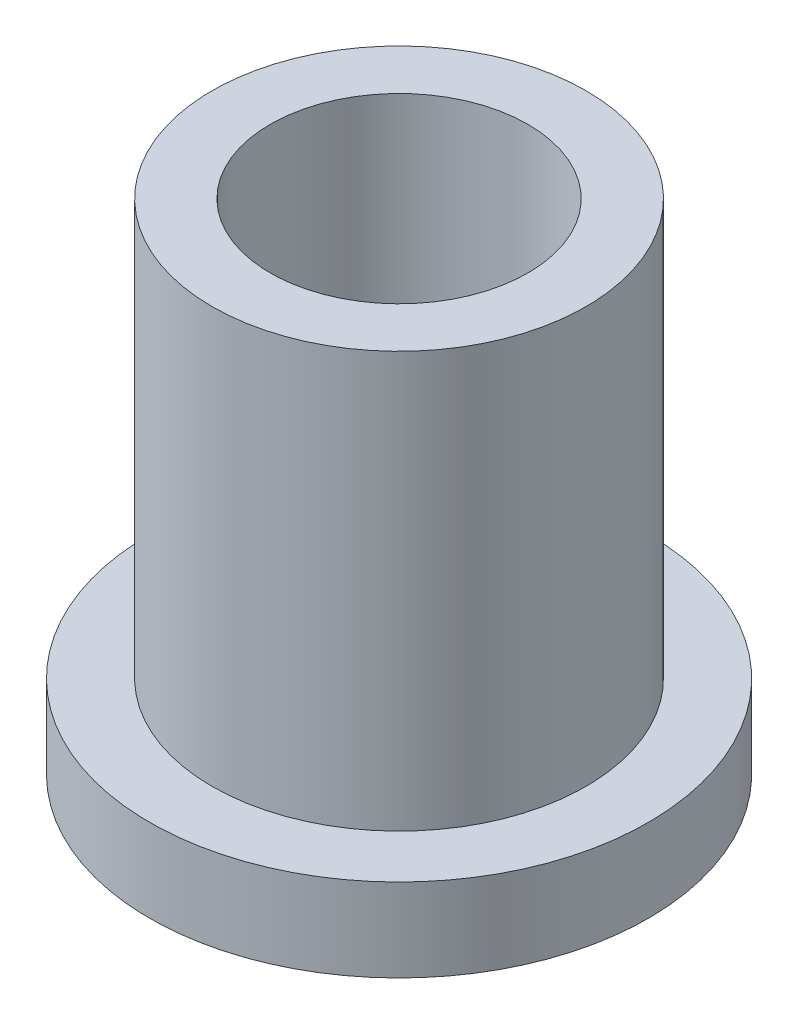
ISO-10303-21;
HEADER;
FILE_DESCRIPTION(('STEP AP214'),'2;1');
FILE_NAME('part.step','',(''),(''),'','','');
FILE_SCHEMA(('AUTOMOTIVE_DESIGN { 1 0 10303 214 1 1 1 1 }'));
ENDSEC;
DATA;
#1=APPLICATION_CONTEXT('core data for automotive mechanical design processes');
#2=APPLICATION_PROTOCOL_DEFINITION('international standard','automotive_design',2000,#1);
#3=PRODUCT_CONTEXT('',#1,'mechanical');
#4=PRODUCT('Part','Part','',(#3));
#5=PRODUCT_RELATED_PRODUCT_CATEGORY('part','',(#4));
#6=PRODUCT_DEFINITION_FORMATION('','',#4);
#7=PRODUCT_DEFINITION_CONTEXT('part definition',#1,'design');
#8=PRODUCT_DEFINITION('design','',#6,#7);
#9=PRODUCT_DEFINITION_SHAPE('','',#8);
#10=(LENGTH_UNIT() NAMED_UNIT(*) SI_UNIT(.MILLI.,.METRE.));
#11=(NAMED_UNIT(*) PLANE_ANGLE_UNIT() SI_UNIT($,.RADIAN.));
#12=(NAMED_UNIT(*) SI_UNIT($,.STERADIAN.) SOLID_ANGLE_UNIT());
#13=UNCERTAINTY_MEASURE_WITH_UNIT(LENGTH_MEASURE(1.E-05),#10,'distance_accuracy_value','');
#14=(GEOMETRIC_REPRESENTATION_CONTEXT(3) GLOBAL_UNCERTAINTY_ASSIGNED_CONTEXT((#13)) GLOBAL_UNIT_ASSIGNED_CONTEXT((#10,
#11,#12)) REPRESENTATION_CONTEXT('',''));
#15=CARTESIAN_POINT('',(0.,0.,0.));
#16=DIRECTION('',(0.,0.,1.));
#17=DIRECTION('',(1.,0.,0.));
#18=AXIS2_PLACEMENT_3D('',#15,#16,#17);
#19=CARTESIAN_POINT('',(2.25,6.,0.));
#20=DIRECTION('',(0.,1.,0.));
#21=DIRECTION('',(0.,0.,1.));
#22=AXIS2_PLACEMENT_3D('',#19,#20,#21);
#23=PLANE('',#22);
#24=CARTESIAN_POINT('',(0.,6.,0.));
#25=DIRECTION('',(0.,-1.,0.));
#26=DIRECTION('',(0.,0.,-1.));
#27=AXIS2_PLACEMENT_3D('',#24,#25,#26);
#28=CIRCLE('',#27,1.55);
#29=CARTESIAN_POINT('',(0.,6.,-1.55));
#30=VERTEX_POINT('',#29);
#31=EDGE_CURVE('E10',#30,#30,#28,.T.);
#32=ORIENTED_EDGE('',*,*,#31,.T.);
#33=EDGE_LOOP('',(#32));
#34=FACE_BOUND('',#33,.T.);
#35=CARTESIAN_POINT('',(0.,6.,0.));
#36=DIRECTION('',(0.,-1.,0.));
#37=DIRECTION('',(0.,0.,-1.));
#38=AXIS2_PLACEMENT_3D('',#35,#36,#37);
#39=CIRCLE('',#38,2.25);
#40=CARTESIAN_POINT('',(0.,6.,-2.25));
#41=VERTEX_POINT('',#40);
#42=EDGE_CURVE('E51',#41,#41,#39,.T.);
#43=ORIENTED_EDGE('',*,*,#42,.F.);
#44=EDGE_LOOP('',(#43));
#45=FACE_BOUND('',#44,.T.);
#46=ADVANCED_FACE('F29',(#34,#45),#23,.T.);
#47=CARTESIAN_POINT('',(0.,0.,0.));
#48=DIRECTION('',(0.,-1.,0.));
#49=DIRECTION('',(0.,0.,-1.));
#50=AXIS2_PLACEMENT_3D('',#47,#48,#49);
#51=CYLINDRICAL_SURFACE('',#50,1.55);
#52=CARTESIAN_POINT('',(0.,0.,0.));
#53=DIRECTION('',(0.,-1.,0.));
#54=DIRECTION('',(0.,0.,-1.));
#55=AXIS2_PLACEMENT_3D('',#52,#53,#54);
#56=CIRCLE('',#55,1.55);
#57=CARTESIAN_POINT('',(0.,0.,-1.55));
#58=VERTEX_POINT('',#57);
#59=EDGE_CURVE('E35',#58,#58,#56,.T.);
#60=ORIENTED_EDGE('',*,*,#59,.T.);
#61=EDGE_LOOP('',(#60));
#62=FACE_BOUND('',#61,.T.);
#63=ORIENTED_EDGE('',*,*,#31,.F.);
#64=EDGE_LOOP('',(#63));
#65=FACE_BOUND('',#64,.T.);
#66=ADVANCED_FACE('F59',(#62,#65),#51,.F.);
#67=CARTESIAN_POINT('',(1.55,0.,0.));
#68=DIRECTION('',(0.,-1.,0.));
#69=DIRECTION('',(0.,0.,-1.));
#70=AXIS2_PLACEMENT_3D('',#67,#68,#69);
#71=PLANE('',#70);
#72=CARTESIAN_POINT('',(0.,0.,0.));
#73=DIRECTION('',(0.,-1.,0.));
#74=DIRECTION('',(0.,0.,-1.));
#75=AXIS2_PLACEMENT_3D('',#72,#73,#74);
#76=CIRCLE('',#75,3.);
#77=CARTESIAN_POINT('',(0.,0.,-3.));
#78=VERTEX_POINT('',#77);
#79=EDGE_CURVE('E39',#78,#78,#76,.T.);
#80=ORIENTED_EDGE('',*,*,#79,.T.);
#81=EDGE_LOOP('',(#80));
#82=FACE_BOUND('',#81,.T.);
#83=ORIENTED_EDGE('',*,*,#59,.F.);
#84=EDGE_LOOP('',(#83));
#85=FACE_BOUND('',#84,.T.);
#86=ADVANCED_FACE('F63',(#82,#85),#71,.T.);
#87=CARTESIAN_POINT('',(0.,0.,0.));
#88=DIRECTION('',(0.,-1.,0.));
#89=DIRECTION('',(0.,0.,-1.));
#90=AXIS2_PLACEMENT_3D('',#87,#88,#89);
#91=CYLINDRICAL_SURFACE('',#90,3.);
#92=CARTESIAN_POINT('',(0.,1.,0.));
#93=DIRECTION('',(0.,-1.,0.));
#94=DIRECTION('',(0.,0.,-1.));
#95=AXIS2_PLACEMENT_3D('',#92,#93,#94);
#96=CIRCLE('',#95,3.);
#97=CARTESIAN_POINT('',(0.,1.,-3.));
#98=VERTEX_POINT('',#97);
#99=EDGE_CURVE('E43',#98,#98,#96,.T.);
#100=ORIENTED_EDGE('',*,*,#99,.T.);
#101=EDGE_LOOP('',(#100));
#102=FACE_BOUND('',#101,.T.);
#103=ORIENTED_EDGE('',*,*,#79,.F.);
#104=EDGE_LOOP('',(#103));
#105=FACE_BOUND('',#104,.T.);
#106=ADVANCED_FACE('F67',(#102,#105),#91,.T.);
#107=CARTESIAN_POINT('',(3.,1.,0.));
#108=DIRECTION('',(0.,1.,0.));
#109=DIRECTION('',(0.,0.,1.));
#110=AXIS2_PLACEMENT_3D('',#107,#108,#109);
#111=PLANE('',#110);
#112=CARTESIAN_POINT('',(0.,1.,0.));
#113=DIRECTION('',(0.,-1.,0.));
#114=DIRECTION('',(0.,0.,-1.));
#115=AXIS2_PLACEMENT_3D('',#112,#113,#114);
#116=CIRCLE('',#115,2.25);
#117=CARTESIAN_POINT('',(0.,1.,-2.25));
#118=VERTEX_POINT('',#117);
#119=EDGE_CURVE('E48',#118,#118,#116,.T.);
#120=ORIENTED_EDGE('',*,*,#119,.T.);
#121=EDGE_LOOP('',(#120));
#122=FACE_BOUND('',#121,.T.);
#123=ORIENTED_EDGE('',*,*,#99,.F.);
#124=EDGE_LOOP('',(#123));
#125=FACE_BOUND('',#124,.T.);
#126=ADVANCED_FACE('F74',(#122,#125),#111,.T.);
#127=CARTESIAN_POINT('',(0.,0.,0.));
#128=DIRECTION('',(0.,-1.,0.));
#129=DIRECTION('',(0.,0.,-1.));
#130=AXIS2_PLACEMENT_3D('',#127,#128,#129);
#131=CYLINDRICAL_SURFACE('',#130,2.25);
#132=ORIENTED_EDGE('',*,*,#42,.T.);
#133=EDGE_LOOP('',(#132));
#134=FACE_BOUND('',#133,.T.);
#135=ORIENTED_EDGE('',*,*,#119,.F.);
#136=EDGE_LOOP('',(#135));
#137=FACE_BOUND('',#136,.T.);
#138=ADVANCED_FACE('F55',(#134,#137),#131,.T.);
#139=CLOSED_SHELL('',(#46,#66,#86,#106,#126,#138));
#140=MANIFOLD_SOLID_BREP('B2',#139);
#141=ADVANCED_BREP_SHAPE_REPRESENTATION('',(#18,#140),#14);
#142=SHAPE_DEFINITION_REPRESENTATION(#9,#141);
ENDSEC;
END-ISO-10303-21;
